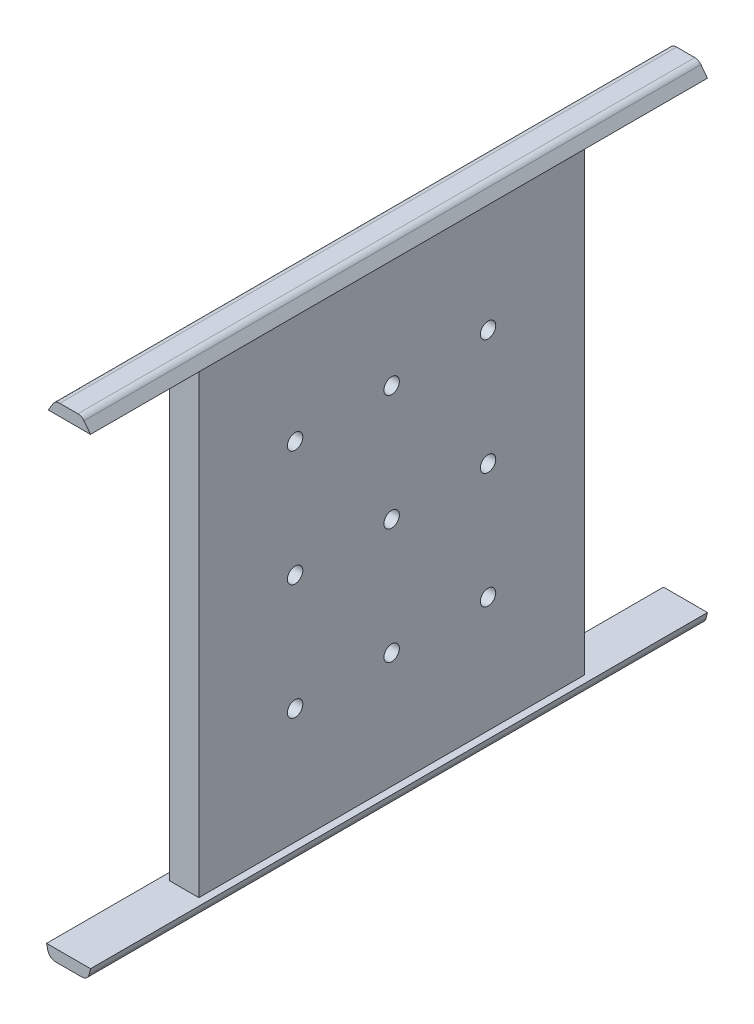
ISO-10303-21;
HEADER;
FILE_DESCRIPTION(('STEP AP214'),'2;1');
FILE_NAME('part.step','',(''),(''),'','','');
FILE_SCHEMA(('AUTOMOTIVE_DESIGN { 1 0 10303 214 1 1 1 1 }'));
ENDSEC;
DATA;
#1=APPLICATION_CONTEXT('core data for automotive mechanical design processes');
#2=APPLICATION_PROTOCOL_DEFINITION('international standard','automotive_design',2000,#1);
#3=PRODUCT_CONTEXT('',#1,'mechanical');
#4=PRODUCT('Part','Part','',(#3));
#5=PRODUCT_RELATED_PRODUCT_CATEGORY('part','',(#4));
#6=PRODUCT_DEFINITION_FORMATION('','',#4);
#7=PRODUCT_DEFINITION_CONTEXT('part definition',#1,'design');
#8=PRODUCT_DEFINITION('design','',#6,#7);
#9=PRODUCT_DEFINITION_SHAPE('','',#8);
#10=(LENGTH_UNIT() NAMED_UNIT(*) SI_UNIT(.MILLI.,.METRE.));
#11=(NAMED_UNIT(*) PLANE_ANGLE_UNIT() SI_UNIT($,.RADIAN.));
#12=(NAMED_UNIT(*) SI_UNIT($,.STERADIAN.) SOLID_ANGLE_UNIT());
#13=UNCERTAINTY_MEASURE_WITH_UNIT(LENGTH_MEASURE(1.E-05),#10,'distance_accuracy_value','');
#14=(GEOMETRIC_REPRESENTATION_CONTEXT(3) GLOBAL_UNCERTAINTY_ASSIGNED_CONTEXT((#13)) GLOBAL_UNIT_ASSIGNED_CONTEXT((#10,
#11,#12)) REPRESENTATION_CONTEXT('',''));
#15=CARTESIAN_POINT('',(0.,0.,0.));
#16=DIRECTION('',(0.,0.,1.));
#17=DIRECTION('',(1.,0.,0.));
#18=AXIS2_PLACEMENT_3D('',#15,#16,#17);
#19=CARTESIAN_POINT('',(-3.8,0.,160.));
#20=DIRECTION('',(-1.,0.,0.));
#21=DIRECTION('',(0.,-1.,0.));
#22=AXIS2_PLACEMENT_3D('',#19,#20,#21);
#23=PLANE('',#22);
#24=CARTESIAN_POINT('',(-3.79999999999999,-38.178624658982,105.042568922673));
#25=DIRECTION('',(-1.,0.,0.));
#26=DIRECTION('',(0.,-1.,0.));
#27=AXIS2_PLACEMENT_3D('',#24,#25,#26);
#28=CIRCLE('',#27,2.);
#29=CARTESIAN_POINT('',(-3.79999999999999,-40.178624658982,105.042568922673));
#30=VERTEX_POINT('',#29);
#31=EDGE_CURVE('E307',#30,#30,#28,.F.);
#32=ORIENTED_EDGE('',*,*,#31,.T.);
#33=EDGE_LOOP('',(#32));
#34=FACE_BOUND('',#33,.T.);
#35=CARTESIAN_POINT('',(-3.79999999999999,-8.17862465898205,55.));
#36=DIRECTION('',(-1.,0.,0.));
#37=DIRECTION('',(0.,-1.,0.));
#38=AXIS2_PLACEMENT_3D('',#35,#36,#37);
#39=CIRCLE('',#38,2.);
#40=CARTESIAN_POINT('',(-3.79999999999999,-10.178624658982,55.));
#41=VERTEX_POINT('',#40);
#42=EDGE_CURVE('E311',#41,#41,#39,.F.);
#43=ORIENTED_EDGE('',*,*,#42,.T.);
#44=EDGE_LOOP('',(#43));
#45=FACE_BOUND('',#44,.T.);
#46=CARTESIAN_POINT('',(-3.79999999999999,-68.178624658982,55.));
#47=DIRECTION('',(-1.,0.,0.));
#48=DIRECTION('',(0.,-1.,0.));
#49=AXIS2_PLACEMENT_3D('',#46,#47,#48);
#50=CIRCLE('',#49,2.);
#51=CARTESIAN_POINT('',(-3.79999999999999,-70.178624658982,55.));
#52=VERTEX_POINT('',#51);
#53=EDGE_CURVE('E315',#52,#52,#50,.F.);
#54=ORIENTED_EDGE('',*,*,#53,.T.);
#55=EDGE_LOOP('',(#54));
#56=FACE_BOUND('',#55,.T.);
#57=CARTESIAN_POINT('',(-3.79999999999999,-8.17862465898205,80.));
#58=DIRECTION('',(-1.,0.,0.));
#59=DIRECTION('',(0.,-1.,0.));
#60=AXIS2_PLACEMENT_3D('',#57,#58,#59);
#61=CIRCLE('',#60,2.);
#62=CARTESIAN_POINT('',(-3.79999999999999,-10.178624658982,80.));
#63=VERTEX_POINT('',#62);
#64=EDGE_CURVE('E319',#63,#63,#61,.F.);
#65=ORIENTED_EDGE('',*,*,#64,.T.);
#66=EDGE_LOOP('',(#65));
#67=FACE_BOUND('',#66,.T.);
#68=DIRECTION('',(0.,-1.,0.));
#69=VECTOR('',#68,1.);
#70=CARTESIAN_POINT('',(-3.8,21.821375341018,130.));
#71=LINE('',#70,#69);
#72=CARTESIAN_POINT('',(-3.8,21.821375341018,130.));
#73=VERTEX_POINT('',#72);
#74=CARTESIAN_POINT('',(-3.8,-98.178624658982,130.));
#75=VERTEX_POINT('',#74);
#76=EDGE_CURVE('E325',#73,#75,#71,.T.);
#77=ORIENTED_EDGE('',*,*,#76,.F.);
#78=DIRECTION('',(0.,0.,-1.));
#79=VECTOR('',#78,1.);
#80=CARTESIAN_POINT('',(-3.8,21.821375341018,160.));
#81=LINE('',#80,#79);
#82=CARTESIAN_POINT('',(-3.8,21.821375341018,30.));
#83=VERTEX_POINT('',#82);
#84=EDGE_CURVE('E12',#73,#83,#81,.T.);
#85=ORIENTED_EDGE('',*,*,#84,.T.);
#86=DIRECTION('',(0.,-1.,0.));
#87=VECTOR('',#86,1.);
#88=CARTESIAN_POINT('',(-3.8,21.821375341018,30.));
#89=LINE('',#88,#87);
#90=CARTESIAN_POINT('',(-3.8,-98.178624658982,30.));
#91=VERTEX_POINT('',#90);
#92=EDGE_CURVE('E391',#83,#91,#89,.T.);
#93=ORIENTED_EDGE('',*,*,#92,.T.);
#94=DIRECTION('',(0.,0.,-1.));
#95=VECTOR('',#94,1.);
#96=CARTESIAN_POINT('',(-3.79999999999998,-98.178624658982,160.));
#97=LINE('',#96,#95);
#98=EDGE_CURVE('E53',#75,#91,#97,.T.);
#99=ORIENTED_EDGE('',*,*,#98,.F.);
#100=EDGE_LOOP('',(#77,#85,#93,#99));
#101=FACE_BOUND('',#100,.T.);
#102=CARTESIAN_POINT('',(-3.79999999999999,-38.178624658982,80.));
#103=DIRECTION('',(-1.,0.,0.));
#104=DIRECTION('',(0.,-1.,0.));
#105=AXIS2_PLACEMENT_3D('',#102,#103,#104);
#106=CIRCLE('',#105,2.);
#107=CARTESIAN_POINT('',(-3.79999999999999,-40.178624658982,80.));
#108=VERTEX_POINT('',#107);
#109=EDGE_CURVE('E330',#108,#108,#106,.F.);
#110=ORIENTED_EDGE('',*,*,#109,.T.);
#111=EDGE_LOOP('',(#110));
#112=FACE_BOUND('',#111,.T.);
#113=CARTESIAN_POINT('',(-3.79999999999999,-68.178624658982,80.));
#114=DIRECTION('',(-1.,0.,0.));
#115=DIRECTION('',(0.,-1.,0.));
#116=AXIS2_PLACEMENT_3D('',#113,#114,#115);
#117=CIRCLE('',#116,2.);
#118=CARTESIAN_POINT('',(-3.79999999999999,-70.178624658982,80.));
#119=VERTEX_POINT('',#118);
#120=EDGE_CURVE('E334',#119,#119,#117,.F.);
#121=ORIENTED_EDGE('',*,*,#120,.T.);
#122=EDGE_LOOP('',(#121));
#123=FACE_BOUND('',#122,.T.);
#124=CARTESIAN_POINT('',(-3.79999999999999,-38.178624658982,55.));
#125=DIRECTION('',(-1.,0.,0.));
#126=DIRECTION('',(0.,-1.,0.));
#127=AXIS2_PLACEMENT_3D('',#124,#125,#126);
#128=CIRCLE('',#127,2.);
#129=CARTESIAN_POINT('',(-3.79999999999999,-40.178624658982,55.));
#130=VERTEX_POINT('',#129);
#131=EDGE_CURVE('E338',#130,#130,#128,.F.);
#132=ORIENTED_EDGE('',*,*,#131,.T.);
#133=EDGE_LOOP('',(#132));
#134=FACE_BOUND('',#133,.T.);
#135=CARTESIAN_POINT('',(-3.79999999999999,-68.178624658982,105.042568922673));
#136=DIRECTION('',(-1.,0.,0.));
#137=DIRECTION('',(0.,-1.,0.));
#138=AXIS2_PLACEMENT_3D('',#135,#136,#137);
#139=CIRCLE('',#138,2.);
#140=CARTESIAN_POINT('',(-3.79999999999999,-70.178624658982,105.042568922673));
#141=VERTEX_POINT('',#140);
#142=EDGE_CURVE('E342',#141,#141,#139,.F.);
#143=ORIENTED_EDGE('',*,*,#142,.T.);
#144=EDGE_LOOP('',(#143));
#145=FACE_BOUND('',#144,.T.);
#146=CARTESIAN_POINT('',(-3.79999999999999,-8.17862465898205,105.042568922673));
#147=DIRECTION('',(-1.,0.,0.));
#148=DIRECTION('',(0.,-1.,0.));
#149=AXIS2_PLACEMENT_3D('',#146,#147,#148);
#150=CIRCLE('',#149,2.);
#151=CARTESIAN_POINT('',(-3.79999999999999,-10.178624658982,105.042568922673));
#152=VERTEX_POINT('',#151);
#153=EDGE_CURVE('E345',#152,#152,#150,.F.);
#154=ORIENTED_EDGE('',*,*,#153,.T.);
#155=EDGE_LOOP('',(#154));
#156=FACE_BOUND('',#155,.T.);
#157=ADVANCED_FACE('F44',(#34,#45,#56,#67,#101,#112,#123,#134,#145,#156),#23,.T.);
#158=CARTESIAN_POINT('',(3.8,0.,160.));
#159=DIRECTION('',(-1.,0.,0.));
#160=DIRECTION('',(0.,-1.,0.));
#161=AXIS2_PLACEMENT_3D('',#158,#159,#160);
#162=PLANE('',#161);
#163=CARTESIAN_POINT('',(3.80000000000001,-38.178624658982,105.042568922673));
#164=DIRECTION('',(1.,0.,0.));
#165=DIRECTION('',(0.,0.,-1.));
#166=AXIS2_PLACEMENT_3D('',#163,#164,#165);
#167=CIRCLE('',#166,2.);
#168=CARTESIAN_POINT('',(3.80000000000001,-38.178624658982,103.042568922673));
#169=VERTEX_POINT('',#168);
#170=EDGE_CURVE('E347',#169,#169,#167,.T.);
#171=ORIENTED_EDGE('',*,*,#170,.F.);
#172=EDGE_LOOP('',(#171));
#173=FACE_BOUND('',#172,.T.);
#174=CARTESIAN_POINT('',(3.8,-8.17862465898205,55.));
#175=DIRECTION('',(1.,0.,0.));
#176=DIRECTION('',(0.,0.,-1.));
#177=AXIS2_PLACEMENT_3D('',#174,#175,#176);
#178=CIRCLE('',#177,2.);
#179=CARTESIAN_POINT('',(3.8,-8.17862465898205,53.));
#180=VERTEX_POINT('',#179);
#181=EDGE_CURVE('E360',#180,#180,#178,.T.);
#182=ORIENTED_EDGE('',*,*,#181,.F.);
#183=EDGE_LOOP('',(#182));
#184=FACE_BOUND('',#183,.T.);
#185=CARTESIAN_POINT('',(3.80000000000002,-68.178624658982,55.));
#186=DIRECTION('',(1.,0.,0.));
#187=DIRECTION('',(0.,0.,-1.));
#188=AXIS2_PLACEMENT_3D('',#185,#186,#187);
#189=CIRCLE('',#188,2.);
#190=CARTESIAN_POINT('',(3.80000000000002,-68.178624658982,53.));
#191=VERTEX_POINT('',#190);
#192=EDGE_CURVE('E368',#191,#191,#189,.T.);
#193=ORIENTED_EDGE('',*,*,#192,.F.);
#194=EDGE_LOOP('',(#193));
#195=FACE_BOUND('',#194,.T.);
#196=CARTESIAN_POINT('',(3.8,-8.17862465898205,80.));
#197=DIRECTION('',(1.,0.,0.));
#198=DIRECTION('',(0.,0.,-1.));
#199=AXIS2_PLACEMENT_3D('',#196,#197,#198);
#200=CIRCLE('',#199,2.);
#201=CARTESIAN_POINT('',(3.8,-8.17862465898205,78.));
#202=VERTEX_POINT('',#201);
#203=EDGE_CURVE('E376',#202,#202,#200,.T.);
#204=ORIENTED_EDGE('',*,*,#203,.F.);
#205=EDGE_LOOP('',(#204));
#206=FACE_BOUND('',#205,.T.);
#207=DIRECTION('',(0.,0.,-1.));
#208=VECTOR('',#207,1.);
#209=CARTESIAN_POINT('',(3.8,21.821375341018,160.));
#210=LINE('',#209,#208);
#211=CARTESIAN_POINT('',(3.80000000000002,21.821375341018,130.));
#212=VERTEX_POINT('',#211);
#213=CARTESIAN_POINT('',(3.80000000000002,21.821375341018,30.));
#214=VERTEX_POINT('',#213);
#215=EDGE_CURVE('E208',#212,#214,#210,.T.);
#216=ORIENTED_EDGE('',*,*,#215,.F.);
#217=DIRECTION('',(0.,1.,0.));
#218=VECTOR('',#217,1.);
#219=CARTESIAN_POINT('',(3.80000000000002,21.821375341018,130.));
#220=LINE('',#219,#218);
#221=CARTESIAN_POINT('',(3.80000000000002,-98.178624658982,130.));
#222=VERTEX_POINT('',#221);
#223=EDGE_CURVE('E387',#222,#212,#220,.T.);
#224=ORIENTED_EDGE('',*,*,#223,.F.);
#225=DIRECTION('',(0.,0.,-1.));
#226=VECTOR('',#225,1.);
#227=CARTESIAN_POINT('',(3.80000000000002,-98.178624658982,160.));
#228=LINE('',#227,#226);
#229=CARTESIAN_POINT('',(3.80000000000002,-98.178624658982,30.));
#230=VERTEX_POINT('',#229);
#231=EDGE_CURVE('E216',#222,#230,#228,.T.);
#232=ORIENTED_EDGE('',*,*,#231,.T.);
#233=DIRECTION('',(0.,1.,0.));
#234=VECTOR('',#233,1.);
#235=CARTESIAN_POINT('',(3.80000000000002,21.821375341018,30.));
#236=LINE('',#235,#234);
#237=EDGE_CURVE('E407',#230,#214,#236,.T.);
#238=ORIENTED_EDGE('',*,*,#237,.T.);
#239=EDGE_LOOP('',(#216,#224,#232,#238));
#240=FACE_BOUND('',#239,.T.);
#241=CARTESIAN_POINT('',(3.80000000000001,-38.178624658982,80.));
#242=DIRECTION('',(1.,0.,0.));
#243=DIRECTION('',(0.,0.,-1.));
#244=AXIS2_PLACEMENT_3D('',#241,#242,#243);
#245=CIRCLE('',#244,2.);
#246=CARTESIAN_POINT('',(3.80000000000001,-38.178624658982,78.));
#247=VERTEX_POINT('',#246);
#248=EDGE_CURVE('E380',#247,#247,#245,.T.);
#249=ORIENTED_EDGE('',*,*,#248,.F.);
#250=EDGE_LOOP('',(#249));
#251=FACE_BOUND('',#250,.T.);
#252=CARTESIAN_POINT('',(3.80000000000002,-68.178624658982,80.));
#253=DIRECTION('',(1.,0.,0.));
#254=DIRECTION('',(0.,0.,-1.));
#255=AXIS2_PLACEMENT_3D('',#252,#253,#254);
#256=CIRCLE('',#255,2.);
#257=CARTESIAN_POINT('',(3.80000000000002,-68.178624658982,78.));
#258=VERTEX_POINT('',#257);
#259=EDGE_CURVE('E372',#258,#258,#256,.T.);
#260=ORIENTED_EDGE('',*,*,#259,.F.);
#261=EDGE_LOOP('',(#260));
#262=FACE_BOUND('',#261,.T.);
#263=CARTESIAN_POINT('',(3.80000000000001,-38.178624658982,55.));
#264=DIRECTION('',(1.,0.,0.));
#265=DIRECTION('',(0.,0.,-1.));
#266=AXIS2_PLACEMENT_3D('',#263,#264,#265);
#267=CIRCLE('',#266,2.);
#268=CARTESIAN_POINT('',(3.80000000000001,-38.178624658982,53.));
#269=VERTEX_POINT('',#268);
#270=EDGE_CURVE('E364',#269,#269,#267,.T.);
#271=ORIENTED_EDGE('',*,*,#270,.F.);
#272=EDGE_LOOP('',(#271));
#273=FACE_BOUND('',#272,.T.);
#274=CARTESIAN_POINT('',(3.80000000000002,-68.178624658982,105.042568922673));
#275=DIRECTION('',(1.,0.,0.));
#276=DIRECTION('',(0.,0.,-1.));
#277=AXIS2_PLACEMENT_3D('',#274,#275,#276);
#278=CIRCLE('',#277,2.);
#279=CARTESIAN_POINT('',(3.80000000000002,-68.178624658982,103.042568922673));
#280=VERTEX_POINT('',#279);
#281=EDGE_CURVE('E356',#280,#280,#278,.T.);
#282=ORIENTED_EDGE('',*,*,#281,.F.);
#283=EDGE_LOOP('',(#282));
#284=FACE_BOUND('',#283,.T.);
#285=CARTESIAN_POINT('',(3.8,-8.17862465898205,105.042568922673));
#286=DIRECTION('',(1.,0.,0.));
#287=DIRECTION('',(0.,0.,-1.));
#288=AXIS2_PLACEMENT_3D('',#285,#286,#287);
#289=CIRCLE('',#288,2.);
#290=CARTESIAN_POINT('',(3.8,-8.17862465898205,103.042568922673));
#291=VERTEX_POINT('',#290);
#292=EDGE_CURVE('E348',#291,#291,#289,.T.);
#293=ORIENTED_EDGE('',*,*,#292,.F.);
#294=EDGE_LOOP('',(#293));
#295=FACE_BOUND('',#294,.T.);
#296=ADVANCED_FACE('F297',(#173,#184,#195,#206,#240,#251,#262,#273,#284,#295),#162,.F.);
#297=CARTESIAN_POINT('',(0.,0.,160.));
#298=DIRECTION('',(0.,0.,1.));
#299=DIRECTION('',(1.,0.,0.));
#300=AXIS2_PLACEMENT_3D('',#297,#298,#299);
#301=PLANE('',#300);
#302=DIRECTION('',(-1.,0.,0.));
#303=VECTOR('',#302,1.);
#304=CARTESIAN_POINT('',(0.,21.821375341018,160.));
#305=LINE('',#304,#303);
#306=CARTESIAN_POINT('',(5.70000000000001,21.821375341018,160.));
#307=VERTEX_POINT('',#306);
#308=CARTESIAN_POINT('',(-5.26679924331625,21.821375341018,160.));
#309=VERTEX_POINT('',#308);
#310=EDGE_CURVE('E200',#307,#309,#305,.T.);
#311=ORIENTED_EDGE('',*,*,#310,.F.);
#312=DIRECTION('',(-0.606268268229279,0.795260200775992,0.));
#313=VECTOR('',#312,1.);
#314=CARTESIAN_POINT('',(14.1258813531818,10.7688950319018,160.));
#315=LINE('',#314,#313);
#316=CARTESIAN_POINT('',(4.01326816928115,24.0339118774765,160.));
#317=VERTEX_POINT('',#316);
#318=EDGE_CURVE('E271',#307,#317,#315,.T.);
#319=ORIENTED_EDGE('',*,*,#318,.T.);
#320=CARTESIAN_POINT('',(2.42274776772917,22.8213753410179,160.));
#321=DIRECTION('',(0.,0.,1.));
#322=DIRECTION('',(1.,0.,0.));
#323=AXIS2_PLACEMENT_3D('',#320,#321,#322);
#324=CIRCLE('',#323,2.);
#325=CARTESIAN_POINT('',(2.42274776772917,24.821375341018,160.));
#326=VERTEX_POINT('',#325);
#327=EDGE_CURVE('E155',#326,#317,#324,.F.);
#328=ORIENTED_EDGE('',*,*,#327,.F.);
#329=DIRECTION('',(-1.,0.,0.));
#330=VECTOR('',#329,1.);
#331=CARTESIAN_POINT('',(0.,24.821375341018,160.));
#332=LINE('',#331,#330);
#333=CARTESIAN_POINT('',(-2.29779279131514,24.821375341018,160.));
#334=VERTEX_POINT('',#333);
#335=EDGE_CURVE('E149',#326,#334,#332,.T.);
#336=ORIENTED_EDGE('',*,*,#335,.T.);
#337=CARTESIAN_POINT('',(-2.29779279131514,22.8213753410179,160.));
#338=DIRECTION('',(0.,0.,1.));
#339=DIRECTION('',(1.,0.,0.));
#340=AXIS2_PLACEMENT_3D('',#337,#338,#339);
#341=CIRCLE('',#340,2.);
#342=CARTESIAN_POINT('',(-3.99915691907052,23.8727364135269,160.));
#343=VERTEX_POINT('',#342);
#344=EDGE_CURVE('E153',#334,#343,#341,.T.);
#345=ORIENTED_EDGE('',*,*,#344,.T.);
#346=DIRECTION('',(-0.52568053625448,-0.850682063877688,0.));
#347=VECTOR('',#346,1.);
#348=CARTESIAN_POINT('',(-13.5696072539082,8.38536360515385,160.));
#349=LINE('',#348,#347);
#350=EDGE_CURVE('E62',#343,#309,#349,.T.);
#351=ORIENTED_EDGE('',*,*,#350,.T.);
#352=EDGE_LOOP('',(#311,#319,#328,#336,#345,#351));
#353=FACE_BOUND('',#352,.T.);
#354=ADVANCED_FACE('F151',(#353),#301,.T.);
#355=DIRECTION('',(-0.227229615606411,-0.973841209741795,0.));
#356=VECTOR('',#355,1.);
#357=CARTESIAN_POINT('',(27.1312025062019,-6.33061391811356,160.));
#358=LINE('',#357,#356);
#359=CARTESIAN_POINT('',(5.70000000000001,-98.1786246589821,160.));
#360=VERTEX_POINT('',#359);
#361=CARTESIAN_POINT('',(5.3606261793837,-99.6330838901949,160.));
#362=VERTEX_POINT('',#361);
#363=EDGE_CURVE('E269',#360,#362,#358,.T.);
#364=ORIENTED_EDGE('',*,*,#363,.F.);
#365=DIRECTION('',(-1.,0.,0.));
#366=VECTOR('',#365,1.);
#367=CARTESIAN_POINT('',(0.,-98.178624658982,160.));
#368=LINE('',#367,#366);
#369=CARTESIAN_POINT('',(-5.69999999999999,-98.178624658982,160.));
#370=VERTEX_POINT('',#369);
#371=EDGE_CURVE('E121',#360,#370,#368,.T.);
#372=ORIENTED_EDGE('',*,*,#371,.T.);
#373=DIRECTION('',(-0.227229615606419,0.973841209741793,0.));
#374=VECTOR('',#373,1.);
#375=CARTESIAN_POINT('',(-27.1312025062026,-6.33061391811397,160.));
#376=LINE('',#375,#374);
#377=CARTESIAN_POINT('',(-5.36062617938366,-99.6330838901949,160.));
#378=VERTEX_POINT('',#377);
#379=EDGE_CURVE('E258',#378,#370,#376,.T.);
#380=ORIENTED_EDGE('',*,*,#379,.F.);
#381=CARTESIAN_POINT('',(-3.41294375990007,-99.178624658982,160.));
#382=DIRECTION('',(0.,0.,1.));
#383=DIRECTION('',(1.,0.,0.));
#384=AXIS2_PLACEMENT_3D('',#381,#382,#383);
#385=CIRCLE('',#384,2.);
#386=CARTESIAN_POINT('',(-3.41294375990007,-101.178624658982,160.));
#387=VERTEX_POINT('',#386);
#388=EDGE_CURVE('E259',#378,#387,#385,.T.);
#389=ORIENTED_EDGE('',*,*,#388,.T.);
#390=DIRECTION('',(1.,0.,0.));
#391=VECTOR('',#390,1.);
#392=CARTESIAN_POINT('',(0.,-101.178624658982,160.));
#393=LINE('',#392,#391);
#394=CARTESIAN_POINT('',(3.4129437599001,-101.178624658982,160.));
#395=VERTEX_POINT('',#394);
#396=EDGE_CURVE('E261',#387,#395,#393,.T.);
#397=ORIENTED_EDGE('',*,*,#396,.T.);
#398=CARTESIAN_POINT('',(3.4129437599001,-99.178624658982,160.));
#399=DIRECTION('',(0.,0.,1.));
#400=DIRECTION('',(1.,0.,0.));
#401=AXIS2_PLACEMENT_3D('',#398,#399,#400);
#402=CIRCLE('',#401,2.);
#403=EDGE_CURVE('E267',#395,#362,#402,.T.);
#404=ORIENTED_EDGE('',*,*,#403,.T.);
#405=EDGE_LOOP('',(#364,#372,#380,#389,#397,#404));
#406=FACE_BOUND('',#405,.T.);
#407=ADVANCED_FACE('F464',(#406),#301,.T.);
#408=CARTESIAN_POINT('',(0.,0.,0.));
#409=DIRECTION('',(0.,0.,1.));
#410=DIRECTION('',(1.,0.,0.));
#411=AXIS2_PLACEMENT_3D('',#408,#409,#410);
#412=PLANE('',#411);
#413=DIRECTION('',(-0.227229615606419,0.973841209741793,0.));
#414=VECTOR('',#413,1.);
#415=CARTESIAN_POINT('',(-27.1312025062026,-6.33061391811397,0.));
#416=LINE('',#415,#414);
#417=CARTESIAN_POINT('',(-5.36062617938366,-99.6330838901949,0.));
#418=VERTEX_POINT('',#417);
#419=CARTESIAN_POINT('',(-5.69999999999999,-98.178624658982,0.));
#420=VERTEX_POINT('',#419);
#421=EDGE_CURVE('E171',#418,#420,#416,.T.);
#422=ORIENTED_EDGE('',*,*,#421,.T.);
#423=DIRECTION('',(1.,0.,0.));
#424=VECTOR('',#423,1.);
#425=CARTESIAN_POINT('',(-7.17106379094956E-13,-98.178624658982,0.));
#426=LINE('',#425,#424);
#427=CARTESIAN_POINT('',(5.70000000000001,-98.1786246589821,0.));
#428=VERTEX_POINT('',#427);
#429=EDGE_CURVE('E185',#420,#428,#426,.T.);
#430=ORIENTED_EDGE('',*,*,#429,.T.);
#431=DIRECTION('',(-0.227229615606411,-0.973841209741795,0.));
#432=VECTOR('',#431,1.);
#433=CARTESIAN_POINT('',(27.1312025062019,-6.33061391811356,0.));
#434=LINE('',#433,#432);
#435=CARTESIAN_POINT('',(5.3606261793837,-99.6330838901949,0.));
#436=VERTEX_POINT('',#435);
#437=EDGE_CURVE('E182',#428,#436,#434,.T.);
#438=ORIENTED_EDGE('',*,*,#437,.T.);
#439=CARTESIAN_POINT('',(3.4129437599001,-99.178624658982,0.));
#440=DIRECTION('',(0.,0.,1.));
#441=DIRECTION('',(1.,0.,0.));
#442=AXIS2_PLACEMENT_3D('',#439,#440,#441);
#443=CIRCLE('',#442,2.);
#444=CARTESIAN_POINT('',(3.4129437599001,-101.178624658982,0.));
#445=VERTEX_POINT('',#444);
#446=EDGE_CURVE('E179',#445,#436,#443,.T.);
#447=ORIENTED_EDGE('',*,*,#446,.F.);
#448=DIRECTION('',(1.,0.,0.));
#449=VECTOR('',#448,1.);
#450=CARTESIAN_POINT('',(0.,-101.178624658982,0.));
#451=LINE('',#450,#449);
#452=CARTESIAN_POINT('',(-3.41294375990007,-101.178624658982,0.));
#453=VERTEX_POINT('',#452);
#454=EDGE_CURVE('E177',#453,#445,#451,.T.);
#455=ORIENTED_EDGE('',*,*,#454,.F.);
#456=CARTESIAN_POINT('',(-3.41294375990007,-99.178624658982,0.));
#457=DIRECTION('',(0.,0.,1.));
#458=DIRECTION('',(1.,0.,0.));
#459=AXIS2_PLACEMENT_3D('',#456,#457,#458);
#460=CIRCLE('',#459,2.);
#461=EDGE_CURVE('E174',#418,#453,#460,.T.);
#462=ORIENTED_EDGE('',*,*,#461,.F.);
#463=EDGE_LOOP('',(#422,#430,#438,#447,#455,#462));
#464=FACE_BOUND('',#463,.T.);
#465=ADVANCED_FACE('F250',(#464),#412,.F.);
#466=DIRECTION('',(-1.,0.,0.));
#467=VECTOR('',#466,1.);
#468=CARTESIAN_POINT('',(0.,21.821375341018,0.));
#469=LINE('',#468,#467);
#470=CARTESIAN_POINT('',(5.70000000000001,21.821375341018,0.));
#471=VERTEX_POINT('',#470);
#472=CARTESIAN_POINT('',(-5.26679924331625,21.821375341018,0.));
#473=VERTEX_POINT('',#472);
#474=EDGE_CURVE('E112',#471,#473,#469,.T.);
#475=ORIENTED_EDGE('',*,*,#474,.T.);
#476=DIRECTION('',(-0.52568053625448,-0.850682063877688,0.));
#477=VECTOR('',#476,1.);
#478=CARTESIAN_POINT('',(-13.5696072539082,8.38536360515385,0.));
#479=LINE('',#478,#477);
#480=CARTESIAN_POINT('',(-3.99915691907052,23.8727364135269,0.));
#481=VERTEX_POINT('',#480);
#482=EDGE_CURVE('E197',#481,#473,#479,.T.);
#483=ORIENTED_EDGE('',*,*,#482,.F.);
#484=CARTESIAN_POINT('',(-2.29779279131514,22.8213753410179,0.));
#485=DIRECTION('',(0.,0.,1.));
#486=DIRECTION('',(1.,0.,0.));
#487=AXIS2_PLACEMENT_3D('',#484,#485,#486);
#488=CIRCLE('',#487,2.);
#489=CARTESIAN_POINT('',(-2.29779279131514,24.821375341018,0.));
#490=VERTEX_POINT('',#489);
#491=EDGE_CURVE('E104',#490,#481,#488,.T.);
#492=ORIENTED_EDGE('',*,*,#491,.F.);
#493=DIRECTION('',(-1.,0.,0.));
#494=VECTOR('',#493,1.);
#495=CARTESIAN_POINT('',(0.,24.821375341018,0.));
#496=LINE('',#495,#494);
#497=CARTESIAN_POINT('',(2.42274776772917,24.821375341018,0.));
#498=VERTEX_POINT('',#497);
#499=EDGE_CURVE('E161',#498,#490,#496,.T.);
#500=ORIENTED_EDGE('',*,*,#499,.F.);
#501=CARTESIAN_POINT('',(2.42274776772917,22.8213753410179,0.));
#502=DIRECTION('',(0.,0.,1.));
#503=DIRECTION('',(1.,0.,0.));
#504=AXIS2_PLACEMENT_3D('',#501,#502,#503);
#505=CIRCLE('',#504,2.);
#506=CARTESIAN_POINT('',(4.01326816928115,24.0339118774765,0.));
#507=VERTEX_POINT('',#506);
#508=EDGE_CURVE('E192',#498,#507,#505,.F.);
#509=ORIENTED_EDGE('',*,*,#508,.T.);
#510=DIRECTION('',(-0.606268268229279,0.795260200775992,0.));
#511=VECTOR('',#510,1.);
#512=CARTESIAN_POINT('',(14.1258813531818,10.7688950319018,0.));
#513=LINE('',#512,#511);
#514=EDGE_CURVE('E189',#471,#507,#513,.T.);
#515=ORIENTED_EDGE('',*,*,#514,.F.);
#516=EDGE_LOOP('',(#475,#483,#492,#500,#509,#515));
#517=FACE_BOUND('',#516,.T.);
#518=ADVANCED_FACE('F276',(#517),#412,.F.);
#519=CARTESIAN_POINT('',(-27.1312025062026,-6.33061391811397,160.));
#520=DIRECTION('',(-0.973841209741793,-0.227229615606419,0.));
#521=DIRECTION('',(0.227229615606419,-0.973841209741793,0.));
#522=AXIS2_PLACEMENT_3D('',#519,#520,#521);
#523=PLANE('',#522);
#524=ORIENTED_EDGE('',*,*,#421,.F.);
#525=DIRECTION('',(0.,0.,-1.));
#526=VECTOR('',#525,1.);
#527=CARTESIAN_POINT('',(-5.36062617938366,-99.6330838901949,160.));
#528=LINE('',#527,#526);
#529=EDGE_CURVE('E231',#378,#418,#528,.T.);
#530=ORIENTED_EDGE('',*,*,#529,.F.);
#531=ORIENTED_EDGE('',*,*,#379,.T.);
#532=DIRECTION('',(0.,0.,-1.));
#533=VECTOR('',#532,1.);
#534=CARTESIAN_POINT('',(-5.69999999999999,-98.178624658982,160.));
#535=LINE('',#534,#533);
#536=EDGE_CURVE('E225',#370,#420,#535,.T.);
#537=ORIENTED_EDGE('',*,*,#536,.T.);
#538=EDGE_LOOP('',(#524,#530,#531,#537));
#539=FACE_BOUND('',#538,.T.);
#540=ADVANCED_FACE('F255',(#539),#523,.T.);
#541=CARTESIAN_POINT('',(-3.41294375990007,-99.178624658982,160.));
#542=DIRECTION('',(0.,0.,-1.));
#543=DIRECTION('',(-1.,0.,0.));
#544=AXIS2_PLACEMENT_3D('',#541,#542,#543);
#545=CYLINDRICAL_SURFACE('',#544,2.);
#546=ORIENTED_EDGE('',*,*,#461,.T.);
#547=DIRECTION('',(0.,0.,-1.));
#548=VECTOR('',#547,1.);
#549=CARTESIAN_POINT('',(-3.41294375990007,-101.178624658982,160.));
#550=LINE('',#549,#548);
#551=EDGE_CURVE('E233',#387,#453,#550,.T.);
#552=ORIENTED_EDGE('',*,*,#551,.F.);
#553=ORIENTED_EDGE('',*,*,#388,.F.);
#554=ORIENTED_EDGE('',*,*,#529,.T.);
#555=EDGE_LOOP('',(#546,#552,#553,#554));
#556=FACE_BOUND('',#555,.T.);
#557=ADVANCED_FACE('F452',(#556),#545,.T.);
#558=CARTESIAN_POINT('',(0.,-101.178624658982,160.));
#559=DIRECTION('',(0.,1.,0.));
#560=DIRECTION('',(0.,0.,1.));
#561=AXIS2_PLACEMENT_3D('',#558,#559,#560);
#562=PLANE('',#561);
#563=ORIENTED_EDGE('',*,*,#454,.T.);
#564=DIRECTION('',(0.,0.,-1.));
#565=VECTOR('',#564,1.);
#566=CARTESIAN_POINT('',(3.4129437599001,-101.178624658982,160.));
#567=LINE('',#566,#565);
#568=EDGE_CURVE('E236',#395,#445,#567,.T.);
#569=ORIENTED_EDGE('',*,*,#568,.F.);
#570=ORIENTED_EDGE('',*,*,#396,.F.);
#571=ORIENTED_EDGE('',*,*,#551,.T.);
#572=EDGE_LOOP('',(#563,#569,#570,#571));
#573=FACE_BOUND('',#572,.T.);
#574=ADVANCED_FACE('F448',(#573),#562,.F.);
#575=CARTESIAN_POINT('',(3.4129437599001,-99.178624658982,160.));
#576=DIRECTION('',(0.,0.,-1.));
#577=DIRECTION('',(-1.,0.,0.));
#578=AXIS2_PLACEMENT_3D('',#575,#576,#577);
#579=CYLINDRICAL_SURFACE('',#578,2.);
#580=ORIENTED_EDGE('',*,*,#446,.T.);
#581=DIRECTION('',(0.,0.,-1.));
#582=VECTOR('',#581,1.);
#583=CARTESIAN_POINT('',(5.3606261793837,-99.6330838901949,160.));
#584=LINE('',#583,#582);
#585=EDGE_CURVE('E239',#362,#436,#584,.T.);
#586=ORIENTED_EDGE('',*,*,#585,.F.);
#587=ORIENTED_EDGE('',*,*,#403,.F.);
#588=ORIENTED_EDGE('',*,*,#568,.T.);
#589=EDGE_LOOP('',(#580,#586,#587,#588));
#590=FACE_BOUND('',#589,.T.);
#591=ADVANCED_FACE('F443',(#590),#579,.T.);
#592=CARTESIAN_POINT('',(27.1312025062019,-6.33061391811356,160.));
#593=DIRECTION('',(0.973841209741795,-0.227229615606411,0.));
#594=DIRECTION('',(0.227229615606411,0.973841209741795,0.));
#595=AXIS2_PLACEMENT_3D('',#592,#593,#594);
#596=PLANE('',#595);
#597=ORIENTED_EDGE('',*,*,#437,.F.);
#598=DIRECTION('',(0.,0.,-1.));
#599=VECTOR('',#598,1.);
#600=CARTESIAN_POINT('',(5.70000000000001,-98.1786246589821,160.));
#601=LINE('',#600,#599);
#602=EDGE_CURVE('E222',#360,#428,#601,.T.);
#603=ORIENTED_EDGE('',*,*,#602,.F.);
#604=ORIENTED_EDGE('',*,*,#363,.T.);
#605=ORIENTED_EDGE('',*,*,#585,.T.);
#606=EDGE_LOOP('',(#597,#603,#604,#605));
#607=FACE_BOUND('',#606,.T.);
#608=ADVANCED_FACE('F246',(#607),#596,.T.);
#609=CARTESIAN_POINT('',(-7.17106379094956E-13,-98.178624658982,160.));
#610=DIRECTION('',(0.,1.,0.));
#611=DIRECTION('',(-1.,0.,0.));
#612=AXIS2_PLACEMENT_3D('',#609,#610,#611);
#613=PLANE('',#612);
#614=DIRECTION('',(1.,0.,0.));
#615=VECTOR('',#614,1.);
#616=CARTESIAN_POINT('',(-3.8,-98.178624658982,130.));
#617=LINE('',#616,#615);
#618=EDGE_CURVE('E392',#75,#222,#617,.T.);
#619=ORIENTED_EDGE('',*,*,#618,.F.);
#620=ORIENTED_EDGE('',*,*,#98,.T.);
#621=DIRECTION('',(1.,0.,0.));
#622=VECTOR('',#621,1.);
#623=CARTESIAN_POINT('',(-3.8,-98.178624658982,30.));
#624=LINE('',#623,#622);
#625=EDGE_CURVE('E405',#91,#230,#624,.T.);
#626=ORIENTED_EDGE('',*,*,#625,.T.);
#627=ORIENTED_EDGE('',*,*,#231,.F.);
#628=EDGE_LOOP('',(#619,#620,#626,#627));
#629=FACE_BOUND('',#628,.T.);
#630=ORIENTED_EDGE('',*,*,#429,.F.);
#631=ORIENTED_EDGE('',*,*,#536,.F.);
#632=ORIENTED_EDGE('',*,*,#371,.F.);
#633=ORIENTED_EDGE('',*,*,#602,.T.);
#634=EDGE_LOOP('',(#630,#631,#632,#633));
#635=FACE_BOUND('',#634,.T.);
#636=ADVANCED_FACE('F243',(#629,#635),#613,.T.);
#637=CARTESIAN_POINT('',(0.,21.821375341018,160.));
#638=DIRECTION('',(0.,-1.,0.));
#639=DIRECTION('',(0.,0.,-1.));
#640=AXIS2_PLACEMENT_3D('',#637,#638,#639);
#641=PLANE('',#640);
#642=DIRECTION('',(-1.,0.,0.));
#643=VECTOR('',#642,1.);
#644=CARTESIAN_POINT('',(-3.8,21.821375341018,130.));
#645=LINE('',#644,#643);
#646=EDGE_CURVE('E384',#212,#73,#645,.T.);
#647=ORIENTED_EDGE('',*,*,#646,.F.);
#648=ORIENTED_EDGE('',*,*,#215,.T.);
#649=DIRECTION('',(-1.,0.,0.));
#650=VECTOR('',#649,1.);
#651=CARTESIAN_POINT('',(-3.8,21.821375341018,30.));
#652=LINE('',#651,#650);
#653=EDGE_CURVE('E175',#214,#83,#652,.T.);
#654=ORIENTED_EDGE('',*,*,#653,.T.);
#655=ORIENTED_EDGE('',*,*,#84,.F.);
#656=EDGE_LOOP('',(#647,#648,#654,#655));
#657=FACE_BOUND('',#656,.T.);
#658=ORIENTED_EDGE('',*,*,#474,.F.);
#659=DIRECTION('',(0.,0.,-1.));
#660=VECTOR('',#659,1.);
#661=CARTESIAN_POINT('',(5.70000000000001,21.821375341018,160.));
#662=LINE('',#661,#660);
#663=EDGE_CURVE('E206',#307,#471,#662,.T.);
#664=ORIENTED_EDGE('',*,*,#663,.F.);
#665=ORIENTED_EDGE('',*,*,#310,.T.);
#666=DIRECTION('',(0.,0.,-1.));
#667=VECTOR('',#666,1.);
#668=CARTESIAN_POINT('',(-5.26679924331625,21.821375341018,160.));
#669=LINE('',#668,#667);
#670=EDGE_CURVE('E167',#309,#473,#669,.T.);
#671=ORIENTED_EDGE('',*,*,#670,.T.);
#672=EDGE_LOOP('',(#658,#664,#665,#671));
#673=FACE_BOUND('',#672,.T.);
#674=ADVANCED_FACE('F282',(#657,#673),#641,.T.);
#675=CARTESIAN_POINT('',(14.1258813531818,10.7688950319018,160.));
#676=DIRECTION('',(-0.795260200775992,-0.606268268229279,0.));
#677=DIRECTION('',(0.606268268229279,-0.795260200775992,0.));
#678=AXIS2_PLACEMENT_3D('',#675,#676,#677);
#679=PLANE('',#678);
#680=ORIENTED_EDGE('',*,*,#514,.T.);
#681=DIRECTION('',(0.,0.,-1.));
#682=VECTOR('',#681,1.);
#683=CARTESIAN_POINT('',(4.01326816928115,24.0339118774765,160.));
#684=LINE('',#683,#682);
#685=EDGE_CURVE('E204',#317,#507,#684,.T.);
#686=ORIENTED_EDGE('',*,*,#685,.F.);
#687=ORIENTED_EDGE('',*,*,#318,.F.);
#688=ORIENTED_EDGE('',*,*,#663,.T.);
#689=EDGE_LOOP('',(#680,#686,#687,#688));
#690=FACE_BOUND('',#689,.T.);
#691=ADVANCED_FACE('F286',(#690),#679,.F.);
#692=CARTESIAN_POINT('',(2.42274776772917,22.8213753410179,160.));
#693=DIRECTION('',(0.,0.,-1.));
#694=DIRECTION('',(-1.,0.,0.));
#695=AXIS2_PLACEMENT_3D('',#692,#693,#694);
#696=CYLINDRICAL_SURFACE('',#695,2.);
#697=ORIENTED_EDGE('',*,*,#508,.F.);
#698=DIRECTION('',(0.,0.,-1.));
#699=VECTOR('',#698,1.);
#700=CARTESIAN_POINT('',(2.42274776772917,24.821375341018,160.));
#701=LINE('',#700,#699);
#702=EDGE_CURVE('E162',#326,#498,#701,.T.);
#703=ORIENTED_EDGE('',*,*,#702,.F.);
#704=ORIENTED_EDGE('',*,*,#327,.T.);
#705=ORIENTED_EDGE('',*,*,#685,.T.);
#706=EDGE_LOOP('',(#697,#703,#704,#705));
#707=FACE_BOUND('',#706,.T.);
#708=ADVANCED_FACE('F274',(#707),#696,.T.);
#709=CARTESIAN_POINT('',(0.,24.821375341018,160.));
#710=DIRECTION('',(0.,-1.,0.));
#711=DIRECTION('',(1.,0.,0.));
#712=AXIS2_PLACEMENT_3D('',#709,#710,#711);
#713=PLANE('',#712);
#714=ORIENTED_EDGE('',*,*,#499,.T.);
#715=DIRECTION('',(0.,0.,-1.));
#716=VECTOR('',#715,1.);
#717=CARTESIAN_POINT('',(-2.29779279131514,24.821375341018,160.));
#718=LINE('',#717,#716);
#719=EDGE_CURVE('E158',#334,#490,#718,.T.);
#720=ORIENTED_EDGE('',*,*,#719,.F.);
#721=ORIENTED_EDGE('',*,*,#335,.F.);
#722=ORIENTED_EDGE('',*,*,#702,.T.);
#723=EDGE_LOOP('',(#714,#720,#721,#722));
#724=FACE_BOUND('',#723,.T.);
#725=ADVANCED_FACE('F159',(#724),#713,.F.);
#726=CARTESIAN_POINT('',(-2.29779279131514,22.8213753410179,160.));
#727=DIRECTION('',(0.,0.,-1.));
#728=DIRECTION('',(-1.,0.,0.));
#729=AXIS2_PLACEMENT_3D('',#726,#727,#728);
#730=CYLINDRICAL_SURFACE('',#729,2.);
#731=ORIENTED_EDGE('',*,*,#491,.T.);
#732=DIRECTION('',(0.,0.,-1.));
#733=VECTOR('',#732,1.);
#734=CARTESIAN_POINT('',(-3.99915691907052,23.8727364135269,160.));
#735=LINE('',#734,#733);
#736=EDGE_CURVE('E163',#343,#481,#735,.T.);
#737=ORIENTED_EDGE('',*,*,#736,.F.);
#738=ORIENTED_EDGE('',*,*,#344,.F.);
#739=ORIENTED_EDGE('',*,*,#719,.T.);
#740=EDGE_LOOP('',(#731,#737,#738,#739));
#741=FACE_BOUND('',#740,.T.);
#742=ADVANCED_FACE('F165',(#741),#730,.T.);
#743=CARTESIAN_POINT('',(-13.5696072539082,8.38536360515385,160.));
#744=DIRECTION('',(0.850682063877688,-0.52568053625448,0.));
#745=DIRECTION('',(0.52568053625448,0.850682063877688,0.));
#746=AXIS2_PLACEMENT_3D('',#743,#744,#745);
#747=PLANE('',#746);
#748=ORIENTED_EDGE('',*,*,#482,.T.);
#749=ORIENTED_EDGE('',*,*,#670,.F.);
#750=ORIENTED_EDGE('',*,*,#350,.F.);
#751=ORIENTED_EDGE('',*,*,#736,.T.);
#752=EDGE_LOOP('',(#748,#749,#750,#751));
#753=FACE_BOUND('',#752,.T.);
#754=ADVANCED_FACE('F278',(#753),#747,.F.);
#755=CARTESIAN_POINT('',(0.,0.,30.));
#756=DIRECTION('',(0.,0.,1.));
#757=DIRECTION('',(1.,0.,0.));
#758=AXIS2_PLACEMENT_3D('',#755,#756,#757);
#759=PLANE('',#758);
#760=ORIENTED_EDGE('',*,*,#92,.F.);
#761=ORIENTED_EDGE('',*,*,#653,.F.);
#762=ORIENTED_EDGE('',*,*,#237,.F.);
#763=ORIENTED_EDGE('',*,*,#625,.F.);
#764=EDGE_LOOP('',(#760,#761,#762,#763));
#765=FACE_BOUND('',#764,.T.);
#766=ADVANCED_FACE('F419',(#765),#759,.F.);
#767=CARTESIAN_POINT('',(0.,0.,130.));
#768=DIRECTION('',(0.,0.,-1.));
#769=DIRECTION('',(-1.,0.,0.));
#770=AXIS2_PLACEMENT_3D('',#767,#768,#769);
#771=PLANE('',#770);
#772=ORIENTED_EDGE('',*,*,#76,.T.);
#773=ORIENTED_EDGE('',*,*,#618,.T.);
#774=ORIENTED_EDGE('',*,*,#223,.T.);
#775=ORIENTED_EDGE('',*,*,#646,.T.);
#776=EDGE_LOOP('',(#772,#773,#774,#775));
#777=FACE_BOUND('',#776,.T.);
#778=ADVANCED_FACE('F435',(#777),#771,.F.);
#779=CARTESIAN_POINT('',(3.80000000000001,-38.178624658982,80.));
#780=DIRECTION('',(-1.,0.,0.));
#781=DIRECTION('',(0.,-1.,0.));
#782=AXIS2_PLACEMENT_3D('',#779,#780,#781);
#783=CYLINDRICAL_SURFACE('',#782,2.);
#784=ORIENTED_EDGE('',*,*,#109,.F.);
#785=EDGE_LOOP('',(#784));
#786=FACE_BOUND('',#785,.T.);
#787=ORIENTED_EDGE('',*,*,#248,.T.);
#788=EDGE_LOOP('',(#787));
#789=FACE_BOUND('',#788,.T.);
#790=ADVANCED_FACE('F498',(#786,#789),#783,.F.);
#791=CARTESIAN_POINT('',(3.8,-8.17862465898205,80.));
#792=DIRECTION('',(-1.,0.,0.));
#793=DIRECTION('',(0.,-1.,0.));
#794=AXIS2_PLACEMENT_3D('',#791,#792,#793);
#795=CYLINDRICAL_SURFACE('',#794,2.);
#796=ORIENTED_EDGE('',*,*,#64,.F.);
#797=EDGE_LOOP('',(#796));
#798=FACE_BOUND('',#797,.T.);
#799=ORIENTED_EDGE('',*,*,#203,.T.);
#800=EDGE_LOOP('',(#799));
#801=FACE_BOUND('',#800,.T.);
#802=ADVANCED_FACE('F506',(#798,#801),#795,.F.);
#803=CARTESIAN_POINT('',(3.80000000000002,-68.178624658982,80.));
#804=DIRECTION('',(-1.,0.,0.));
#805=DIRECTION('',(0.,-1.,0.));
#806=AXIS2_PLACEMENT_3D('',#803,#804,#805);
#807=CYLINDRICAL_SURFACE('',#806,2.);
#808=ORIENTED_EDGE('',*,*,#120,.F.);
#809=EDGE_LOOP('',(#808));
#810=FACE_BOUND('',#809,.T.);
#811=ORIENTED_EDGE('',*,*,#259,.T.);
#812=EDGE_LOOP('',(#811));
#813=FACE_BOUND('',#812,.T.);
#814=ADVANCED_FACE('F515',(#810,#813),#807,.F.);
#815=CARTESIAN_POINT('',(3.80000000000002,-68.178624658982,55.));
#816=DIRECTION('',(-1.,0.,0.));
#817=DIRECTION('',(0.,-1.,0.));
#818=AXIS2_PLACEMENT_3D('',#815,#816,#817);
#819=CYLINDRICAL_SURFACE('',#818,2.);
#820=ORIENTED_EDGE('',*,*,#53,.F.);
#821=EDGE_LOOP('',(#820));
#822=FACE_BOUND('',#821,.T.);
#823=ORIENTED_EDGE('',*,*,#192,.T.);
#824=EDGE_LOOP('',(#823));
#825=FACE_BOUND('',#824,.T.);
#826=ADVANCED_FACE('F523',(#822,#825),#819,.F.);
#827=CARTESIAN_POINT('',(3.80000000000001,-38.178624658982,55.));
#828=DIRECTION('',(-1.,0.,0.));
#829=DIRECTION('',(0.,-1.,0.));
#830=AXIS2_PLACEMENT_3D('',#827,#828,#829);
#831=CYLINDRICAL_SURFACE('',#830,2.);
#832=ORIENTED_EDGE('',*,*,#131,.F.);
#833=EDGE_LOOP('',(#832));
#834=FACE_BOUND('',#833,.T.);
#835=ORIENTED_EDGE('',*,*,#270,.T.);
#836=EDGE_LOOP('',(#835));
#837=FACE_BOUND('',#836,.T.);
#838=ADVANCED_FACE('F531',(#834,#837),#831,.F.);
#839=CARTESIAN_POINT('',(3.8,-8.17862465898205,55.));
#840=DIRECTION('',(-1.,0.,0.));
#841=DIRECTION('',(0.,-1.,0.));
#842=AXIS2_PLACEMENT_3D('',#839,#840,#841);
#843=CYLINDRICAL_SURFACE('',#842,2.);
#844=ORIENTED_EDGE('',*,*,#42,.F.);
#845=EDGE_LOOP('',(#844));
#846=FACE_BOUND('',#845,.T.);
#847=ORIENTED_EDGE('',*,*,#181,.T.);
#848=EDGE_LOOP('',(#847));
#849=FACE_BOUND('',#848,.T.);
#850=ADVANCED_FACE('F539',(#846,#849),#843,.F.);
#851=CARTESIAN_POINT('',(3.80000000000002,-68.178624658982,105.042568922673));
#852=DIRECTION('',(-1.,0.,0.));
#853=DIRECTION('',(0.,-1.,0.));
#854=AXIS2_PLACEMENT_3D('',#851,#852,#853);
#855=CYLINDRICAL_SURFACE('',#854,2.);
#856=ORIENTED_EDGE('',*,*,#142,.F.);
#857=EDGE_LOOP('',(#856));
#858=FACE_BOUND('',#857,.T.);
#859=ORIENTED_EDGE('',*,*,#281,.T.);
#860=EDGE_LOOP('',(#859));
#861=FACE_BOUND('',#860,.T.);
#862=ADVANCED_FACE('F547',(#858,#861),#855,.F.);
#863=CARTESIAN_POINT('',(3.80000000000001,-38.178624658982,105.042568922673));
#864=DIRECTION('',(-1.,0.,0.));
#865=DIRECTION('',(0.,-1.,0.));
#866=AXIS2_PLACEMENT_3D('',#863,#864,#865);
#867=CYLINDRICAL_SURFACE('',#866,2.);
#868=ORIENTED_EDGE('',*,*,#31,.F.);
#869=EDGE_LOOP('',(#868));
#870=FACE_BOUND('',#869,.T.);
#871=ORIENTED_EDGE('',*,*,#170,.T.);
#872=EDGE_LOOP('',(#871));
#873=FACE_BOUND('',#872,.T.);
#874=ADVANCED_FACE('F555',(#870,#873),#867,.F.);
#875=CARTESIAN_POINT('',(3.8,-8.17862465898205,105.042568922673));
#876=DIRECTION('',(-1.,0.,0.));
#877=DIRECTION('',(0.,-1.,0.));
#878=AXIS2_PLACEMENT_3D('',#875,#876,#877);
#879=CYLINDRICAL_SURFACE('',#878,2.);
#880=ORIENTED_EDGE('',*,*,#153,.F.);
#881=EDGE_LOOP('',(#880));
#882=FACE_BOUND('',#881,.T.);
#883=ORIENTED_EDGE('',*,*,#292,.T.);
#884=EDGE_LOOP('',(#883));
#885=FACE_BOUND('',#884,.T.);
#886=ADVANCED_FACE('F563',(#882,#885),#879,.F.);
#887=CLOSED_SHELL('',(#157,#296,#354,#407,#465,#518,#540,#557,#574,#591,#608,#636,#674,#691,
#708,#725,#742,#754,#766,#778,#790,#802,#814,#826,#838,#850,#862,#874,#886));
#888=MANIFOLD_SOLID_BREP('B2',#887);
#889=ADVANCED_BREP_SHAPE_REPRESENTATION('',(#18,#888),#14);
#890=SHAPE_DEFINITION_REPRESENTATION(#9,#889);
ENDSEC;
END-ISO-10303-21;
